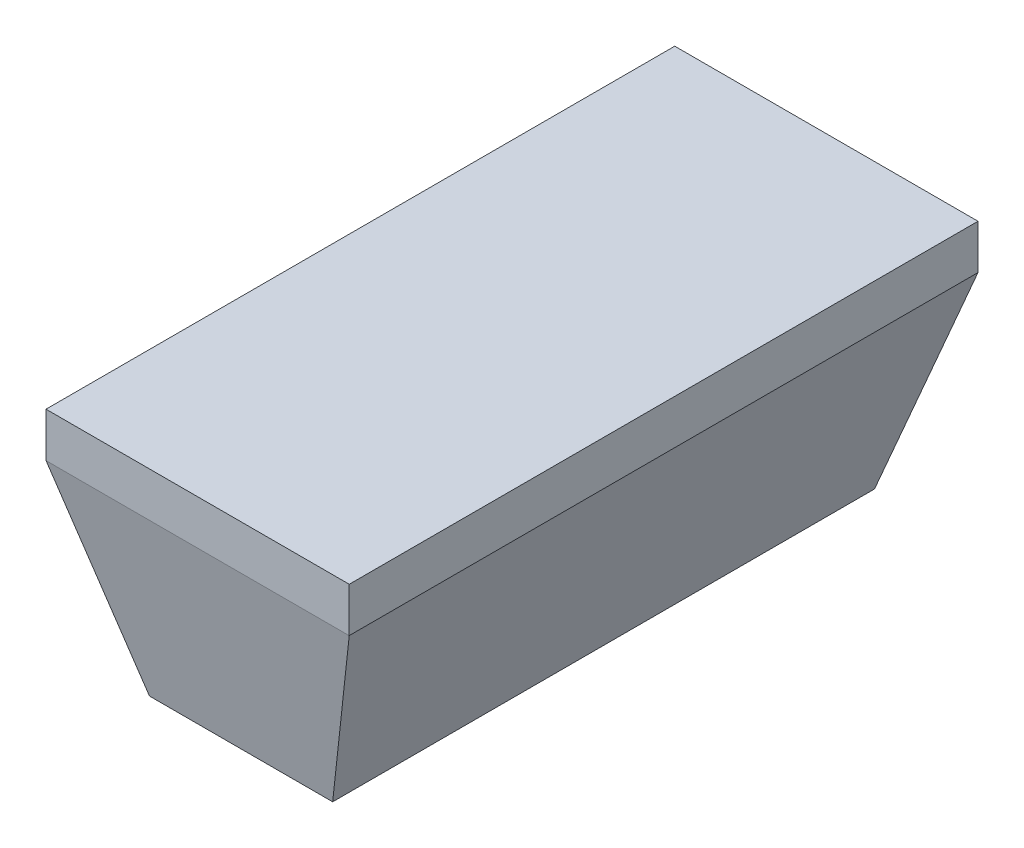
ISO-10303-21;
HEADER;
FILE_DESCRIPTION(('STEP AP214'),'2;1');
FILE_NAME('part.step','',(''),(''),'','','');
FILE_SCHEMA(('AUTOMOTIVE_DESIGN { 1 0 10303 214 1 1 1 1 }'));
ENDSEC;
DATA;
#1=APPLICATION_CONTEXT('core data for automotive mechanical design processes');
#2=APPLICATION_PROTOCOL_DEFINITION('international standard','automotive_design',2000,#1);
#3=PRODUCT_CONTEXT('',#1,'mechanical');
#4=PRODUCT('Part','Part','',(#3));
#5=PRODUCT_RELATED_PRODUCT_CATEGORY('part','',(#4));
#6=PRODUCT_DEFINITION_FORMATION('','',#4);
#7=PRODUCT_DEFINITION_CONTEXT('part definition',#1,'design');
#8=PRODUCT_DEFINITION('design','',#6,#7);
#9=PRODUCT_DEFINITION_SHAPE('','',#8);
#10=(LENGTH_UNIT() NAMED_UNIT(*) SI_UNIT(.MILLI.,.METRE.));
#11=(NAMED_UNIT(*) PLANE_ANGLE_UNIT() SI_UNIT($,.RADIAN.));
#12=(NAMED_UNIT(*) SI_UNIT($,.STERADIAN.) SOLID_ANGLE_UNIT());
#13=UNCERTAINTY_MEASURE_WITH_UNIT(LENGTH_MEASURE(1.E-05),#10,'distance_accuracy_value','');
#14=(GEOMETRIC_REPRESENTATION_CONTEXT(3) GLOBAL_UNCERTAINTY_ASSIGNED_CONTEXT((#13)) GLOBAL_UNIT_ASSIGNED_CONTEXT((#10,
#11,#12)) REPRESENTATION_CONTEXT('',''));
#15=CARTESIAN_POINT('',(0.,0.,0.));
#16=DIRECTION('',(0.,0.,1.));
#17=DIRECTION('',(1.,0.,0.));
#18=AXIS2_PLACEMENT_3D('',#15,#16,#17);
#19=CARTESIAN_POINT('',(-10.,1.18257126518984,8.355));
#20=DIRECTION('',(0.,-1.,0.));
#21=DIRECTION('',(0.,0.,-1.));
#22=AXIS2_PLACEMENT_3D('',#19,#20,#21);
#23=PLANE('',#22);
#24=DIRECTION('',(0.,0.,-1.));
#25=VECTOR('',#24,1.);
#26=CARTESIAN_POINT('',(-4.02966493200222,1.18257126518984,8.355));
#27=LINE('',#26,#25);
#28=CARTESIAN_POINT('',(-4.02966493200222,1.18257126518984,8.355));
#29=VERTEX_POINT('',#28);
#30=CARTESIAN_POINT('',(-4.02966493200222,1.18257126518984,-8.35499999999999));
#31=VERTEX_POINT('',#30);
#32=EDGE_CURVE('E211',#29,#31,#27,.T.);
#33=ORIENTED_EDGE('',*,*,#32,.F.);
#34=DIRECTION('',(1.,0.,0.));
#35=VECTOR('',#34,1.);
#36=CARTESIAN_POINT('',(-10.,1.18257126518984,8.355));
#37=LINE('',#36,#35);
#38=CARTESIAN_POINT('',(4.02966493200222,1.18257126518984,8.355));
#39=VERTEX_POINT('',#38);
#40=EDGE_CURVE('E228',#29,#39,#37,.T.);
#41=ORIENTED_EDGE('',*,*,#40,.T.);
#42=DIRECTION('',(0.,0.,1.));
#43=VECTOR('',#42,1.);
#44=CARTESIAN_POINT('',(4.02966493200222,1.18257126518984,8.355));
#45=LINE('',#44,#43);
#46=CARTESIAN_POINT('',(4.02966493200222,1.18257126518984,-8.35499999999999));
#47=VERTEX_POINT('',#46);
#48=EDGE_CURVE('E133',#47,#39,#45,.T.);
#49=ORIENTED_EDGE('',*,*,#48,.F.);
#50=DIRECTION('',(1.,0.,0.));
#51=VECTOR('',#50,1.);
#52=CARTESIAN_POINT('',(-10.,1.18257126518984,-8.35499999999999));
#53=LINE('',#52,#51);
#54=EDGE_CURVE('E47',#31,#47,#53,.T.);
#55=ORIENTED_EDGE('',*,*,#54,.F.);
#56=EDGE_LOOP('',(#33,#41,#49,#55));
#57=FACE_BOUND('',#56,.T.);
#58=ADVANCED_FACE('F111',(#57),#23,.F.);
#59=CARTESIAN_POINT('',(-10.,1.18257126518984,-8.35499999999999));
#60=DIRECTION('',(0.,0.,1.));
#61=DIRECTION('',(1.,0.,0.));
#62=AXIS2_PLACEMENT_3D('',#59,#60,#61);
#63=PLANE('',#62);
#64=DIRECTION('',(0.293177022535377,-0.956058174724368,0.));
#65=VECTOR('',#64,1.);
#66=CARTESIAN_POINT('',(-4.02966493200222,0.00133067430586715,-8.35499999999999));
#67=LINE('',#66,#65);
#68=CARTESIAN_POINT('',(-4.02966493200222,0.00133067430586715,-8.35499999999999));
#69=VERTEX_POINT('',#68);
#70=CARTESIAN_POINT('',(-4.02925687824433,0.,-8.35499999999999));
#71=VERTEX_POINT('',#70);
#72=EDGE_CURVE('E185',#69,#71,#67,.T.);
#73=ORIENTED_EDGE('',*,*,#72,.F.);
#74=DIRECTION('',(0.,-1.,0.));
#75=VECTOR('',#74,1.);
#76=CARTESIAN_POINT('',(-4.02966493200222,1.65881620398431,-8.35499999999999));
#77=LINE('',#76,#75);
#78=EDGE_CURVE('E206',#31,#69,#77,.T.);
#79=ORIENTED_EDGE('',*,*,#78,.F.);
#80=ORIENTED_EDGE('',*,*,#54,.T.);
#81=DIRECTION('',(0.,1.,0.));
#82=VECTOR('',#81,1.);
#83=CARTESIAN_POINT('',(4.02966493200222,0.00133067430586715,-8.35499999999999));
#84=LINE('',#83,#82);
#85=CARTESIAN_POINT('',(4.02966493200222,0.00133067430586715,-8.35499999999999));
#86=VERTEX_POINT('',#85);
#87=EDGE_CURVE('E204',#86,#47,#84,.T.);
#88=ORIENTED_EDGE('',*,*,#87,.F.);
#89=DIRECTION('',(0.293177022535377,0.956058174724368,0.));
#90=VECTOR('',#89,1.);
#91=CARTESIAN_POINT('',(4.02966493200222,0.00133067430586715,-8.35499999999999));
#92=LINE('',#91,#90);
#93=CARTESIAN_POINT('',(4.02925687824433,0.,-8.35499999999999));
#94=VERTEX_POINT('',#93);
#95=EDGE_CURVE('E182',#94,#86,#92,.T.);
#96=ORIENTED_EDGE('',*,*,#95,.F.);
#97=DIRECTION('',(1.,0.,0.));
#98=VECTOR('',#97,1.);
#99=CARTESIAN_POINT('',(-10.,0.,-8.35499999999999));
#100=LINE('',#99,#98);
#101=EDGE_CURVE('E118',#71,#94,#100,.T.);
#102=ORIENTED_EDGE('',*,*,#101,.F.);
#103=EDGE_LOOP('',(#73,#79,#80,#88,#96,#102));
#104=FACE_BOUND('',#103,.T.);
#105=ADVANCED_FACE('F245',(#104),#63,.F.);
#106=CARTESIAN_POINT('',(-10.,0.,-8.35499999999999));
#107=DIRECTION('',(0.,0.216875521623372,0.976199266605231));
#108=DIRECTION('',(0.,-0.976199266605231,0.216875521623373));
#109=AXIS2_PLACEMENT_3D('',#106,#107,#108);
#110=PLANE('',#109);
#111=DIRECTION('',(0.286779475732234,0.935195602117443,-0.207766017623043));
#112=VECTOR('',#111,1.);
#113=CARTESIAN_POINT('',(2.87545617256271,-3.76257520841882,-7.51909437203255));
#114=LINE('',#113,#112);
#115=CARTESIAN_POINT('',(2.4346671791149,-5.2,-7.19975152663928));
#116=VERTEX_POINT('',#115);
#117=EDGE_CURVE('E226',#116,#94,#114,.T.);
#118=ORIENTED_EDGE('',*,*,#117,.F.);
#119=DIRECTION('',(1.,0.,0.));
#120=VECTOR('',#119,1.);
#121=CARTESIAN_POINT('',(-10.,-5.2,-7.19975152663928));
#122=LINE('',#121,#120);
#123=CARTESIAN_POINT('',(-2.4346671791149,-5.2,-7.19975152663928));
#124=VERTEX_POINT('',#123);
#125=EDGE_CURVE('E234',#124,#116,#122,.T.);
#126=ORIENTED_EDGE('',*,*,#125,.F.);
#127=DIRECTION('',(0.286779475732234,-0.935195602117443,0.207766017623043));
#128=VECTOR('',#127,1.);
#129=CARTESIAN_POINT('',(-4.52030552658781,1.6013228812278,-8.71075496421076));
#130=LINE('',#129,#128);
#131=EDGE_CURVE('E219',#71,#124,#130,.T.);
#132=ORIENTED_EDGE('',*,*,#131,.F.);
#133=ORIENTED_EDGE('',*,*,#101,.T.);
#134=EDGE_LOOP('',(#118,#126,#132,#133));
#135=FACE_BOUND('',#134,.T.);
#136=ADVANCED_FACE('F241',(#135),#110,.F.);
#137=CARTESIAN_POINT('',(-10.,-5.2,7.20033634332094));
#138=DIRECTION('',(0.,-1.,0.));
#139=DIRECTION('',(0.,0.,-1.));
#140=AXIS2_PLACEMENT_3D('',#137,#138,#139);
#141=PLANE('',#140);
#142=ORIENTED_EDGE('',*,*,#125,.T.);
#143=DIRECTION('',(0.,0.,1.));
#144=VECTOR('',#143,1.);
#145=CARTESIAN_POINT('',(2.4346671791149,-5.2,7.20033634332094));
#146=LINE('',#145,#144);
#147=CARTESIAN_POINT('',(2.4346671791149,-5.2,7.20033634332094));
#148=VERTEX_POINT('',#147);
#149=EDGE_CURVE('E223',#116,#148,#146,.T.);
#150=ORIENTED_EDGE('',*,*,#149,.T.);
#151=DIRECTION('',(1.,0.,0.));
#152=VECTOR('',#151,1.);
#153=CARTESIAN_POINT('',(-10.,-5.2,7.20033634332094));
#154=LINE('',#153,#152);
#155=CARTESIAN_POINT('',(-2.4346671791149,-5.2,7.20033634332094));
#156=VERTEX_POINT('',#155);
#157=EDGE_CURVE('E231',#156,#148,#154,.T.);
#158=ORIENTED_EDGE('',*,*,#157,.F.);
#159=DIRECTION('',(0.,0.,-1.));
#160=VECTOR('',#159,1.);
#161=CARTESIAN_POINT('',(-2.4346671791149,-5.2,7.20033634332094));
#162=LINE('',#161,#160);
#163=EDGE_CURVE('E216',#156,#124,#162,.T.);
#164=ORIENTED_EDGE('',*,*,#163,.T.);
#165=EDGE_LOOP('',(#142,#150,#158,#164));
#166=FACE_BOUND('',#165,.T.);
#167=ADVANCED_FACE('F255',(#166),#141,.T.);
#168=CARTESIAN_POINT('',(-10.,0.,8.355));
#169=DIRECTION('',(0.,-0.216770893761959,0.976222505178836));
#170=DIRECTION('',(0.,-0.976222505178836,-0.216770893761959));
#171=AXIS2_PLACEMENT_3D('',#168,#169,#170);
#172=PLANE('',#171);
#173=ORIENTED_EDGE('',*,*,#157,.T.);
#174=DIRECTION('',(0.286785741088034,0.935216033611623,0.2076653779144));
#175=VECTOR('',#174,1.);
#176=CARTESIAN_POINT('',(2.87540575716328,-3.76273961439562,7.51948102263669));
#177=LINE('',#176,#175);
#178=CARTESIAN_POINT('',(4.02925687824433,0.,8.355));
#179=VERTEX_POINT('',#178);
#180=EDGE_CURVE('E221',#148,#179,#177,.T.);
#181=ORIENTED_EDGE('',*,*,#180,.T.);
#182=DIRECTION('',(1.,0.,0.));
#183=VECTOR('',#182,1.);
#184=CARTESIAN_POINT('',(-10.,0.,8.355));
#185=LINE('',#184,#183);
#186=CARTESIAN_POINT('',(-4.02925687824433,0.,8.355));
#187=VERTEX_POINT('',#186);
#188=EDGE_CURVE('E197',#187,#179,#185,.T.);
#189=ORIENTED_EDGE('',*,*,#188,.F.);
#190=DIRECTION('',(0.286785741088034,-0.935216033611623,-0.2076653779144));
#191=VECTOR('',#190,1.);
#192=CARTESIAN_POINT('',(-4.52032698299152,1.60139285113879,8.71059040870685));
#193=LINE('',#192,#191);
#194=EDGE_CURVE('E213',#187,#156,#193,.T.);
#195=ORIENTED_EDGE('',*,*,#194,.T.);
#196=EDGE_LOOP('',(#173,#181,#189,#195));
#197=FACE_BOUND('',#196,.T.);
#198=ADVANCED_FACE('F257',(#197),#172,.T.);
#199=CARTESIAN_POINT('',(-10.,0.,8.355));
#200=DIRECTION('',(0.,0.,-1.));
#201=DIRECTION('',(-1.,0.,0.));
#202=AXIS2_PLACEMENT_3D('',#199,#200,#201);
#203=PLANE('',#202);
#204=DIRECTION('',(0.293177022535377,-0.956058174724368,0.));
#205=VECTOR('',#204,1.);
#206=CARTESIAN_POINT('',(-4.02966493200222,0.00133067430586715,8.355));
#207=LINE('',#206,#205);
#208=CARTESIAN_POINT('',(-4.02966493200222,0.00133067430586715,8.355));
#209=VERTEX_POINT('',#208);
#210=EDGE_CURVE('E125',#209,#187,#207,.T.);
#211=ORIENTED_EDGE('',*,*,#210,.T.);
#212=ORIENTED_EDGE('',*,*,#188,.T.);
#213=DIRECTION('',(0.293177022535377,0.956058174724368,0.));
#214=VECTOR('',#213,1.);
#215=CARTESIAN_POINT('',(4.02966493200222,0.00133067430586715,8.355));
#216=LINE('',#215,#214);
#217=CARTESIAN_POINT('',(4.02966493200222,0.00133067430586715,8.355));
#218=VERTEX_POINT('',#217);
#219=EDGE_CURVE('E179',#179,#218,#216,.T.);
#220=ORIENTED_EDGE('',*,*,#219,.T.);
#221=DIRECTION('',(0.,1.,0.));
#222=VECTOR('',#221,1.);
#223=CARTESIAN_POINT('',(4.02966493200222,0.00133067430586715,8.355));
#224=LINE('',#223,#222);
#225=EDGE_CURVE('E187',#218,#39,#224,.T.);
#226=ORIENTED_EDGE('',*,*,#225,.T.);
#227=ORIENTED_EDGE('',*,*,#40,.F.);
#228=DIRECTION('',(0.,-1.,0.));
#229=VECTOR('',#228,1.);
#230=CARTESIAN_POINT('',(-4.02966493200222,1.65881620398431,8.355));
#231=LINE('',#230,#229);
#232=EDGE_CURVE('E192',#29,#209,#231,.T.);
#233=ORIENTED_EDGE('',*,*,#232,.T.);
#234=EDGE_LOOP('',(#211,#212,#220,#226,#227,#233));
#235=FACE_BOUND('',#234,.T.);
#236=ADVANCED_FACE('F195',(#235),#203,.F.);
#237=CARTESIAN_POINT('',(4.02966493200222,0.00133067430586715,-8.35499999999999));
#238=DIRECTION('',(1.,0.,0.));
#239=DIRECTION('',(0.,0.,-1.));
#240=AXIS2_PLACEMENT_3D('',#237,#238,#239);
#241=PLANE('',#240);
#242=ORIENTED_EDGE('',*,*,#48,.T.);
#243=ORIENTED_EDGE('',*,*,#225,.F.);
#244=DIRECTION('',(0.,0.,1.));
#245=VECTOR('',#244,1.);
#246=CARTESIAN_POINT('',(4.02966493200222,0.00133067430586715,-8.35499999999999));
#247=LINE('',#246,#245);
#248=EDGE_CURVE('E176',#86,#218,#247,.T.);
#249=ORIENTED_EDGE('',*,*,#248,.F.);
#250=ORIENTED_EDGE('',*,*,#87,.T.);
#251=EDGE_LOOP('',(#242,#243,#249,#250));
#252=FACE_BOUND('',#251,.T.);
#253=ADVANCED_FACE('F188',(#252),#241,.T.);
#254=CARTESIAN_POINT('',(4.02966493200222,0.00133067430586715,-8.35499999999999));
#255=DIRECTION('',(0.956058174724369,-0.293177022535377,0.));
#256=DIRECTION('',(0.293177022535377,0.956058174724369,0.));
#257=AXIS2_PLACEMENT_3D('',#254,#255,#256);
#258=PLANE('',#257);
#259=ORIENTED_EDGE('',*,*,#117,.T.);
#260=ORIENTED_EDGE('',*,*,#95,.T.);
#261=ORIENTED_EDGE('',*,*,#248,.T.);
#262=ORIENTED_EDGE('',*,*,#219,.F.);
#263=ORIENTED_EDGE('',*,*,#180,.F.);
#264=ORIENTED_EDGE('',*,*,#149,.F.);
#265=EDGE_LOOP('',(#259,#260,#261,#262,#263,#264));
#266=FACE_BOUND('',#265,.T.);
#267=ADVANCED_FACE('F177',(#266),#258,.T.);
#268=CARTESIAN_POINT('',(-4.02966493200222,0.00133067430586715,-8.35499999999999));
#269=DIRECTION('',(-0.956058174724369,-0.293177022535377,0.));
#270=DIRECTION('',(0.293177022535377,-0.956058174724369,0.));
#271=AXIS2_PLACEMENT_3D('',#268,#269,#270);
#272=PLANE('',#271);
#273=ORIENTED_EDGE('',*,*,#131,.T.);
#274=ORIENTED_EDGE('',*,*,#163,.F.);
#275=ORIENTED_EDGE('',*,*,#194,.F.);
#276=ORIENTED_EDGE('',*,*,#210,.F.);
#277=DIRECTION('',(0.,0.,1.));
#278=VECTOR('',#277,1.);
#279=CARTESIAN_POINT('',(-4.02966493200222,0.00133067430586715,-8.35499999999999));
#280=LINE('',#279,#278);
#281=EDGE_CURVE('E184',#69,#209,#280,.T.);
#282=ORIENTED_EDGE('',*,*,#281,.F.);
#283=ORIENTED_EDGE('',*,*,#72,.T.);
#284=EDGE_LOOP('',(#273,#274,#275,#276,#282,#283));
#285=FACE_BOUND('',#284,.T.);
#286=ADVANCED_FACE('F252',(#285),#272,.T.);
#287=CARTESIAN_POINT('',(-4.02966493200222,1.65881620398431,-8.35499999999999));
#288=DIRECTION('',(-1.,0.,0.));
#289=DIRECTION('',(0.,0.,1.));
#290=AXIS2_PLACEMENT_3D('',#287,#288,#289);
#291=PLANE('',#290);
#292=ORIENTED_EDGE('',*,*,#32,.T.);
#293=ORIENTED_EDGE('',*,*,#78,.T.);
#294=ORIENTED_EDGE('',*,*,#281,.T.);
#295=ORIENTED_EDGE('',*,*,#232,.F.);
#296=EDGE_LOOP('',(#292,#293,#294,#295));
#297=FACE_BOUND('',#296,.T.);
#298=ADVANCED_FACE('F251',(#297),#291,.T.);
#299=CLOSED_SHELL('',(#58,#105,#136,#167,#198,#236,#253,#267,#286,#298));
#300=MANIFOLD_SOLID_BREP('B7',#299);
#301=ADVANCED_BREP_SHAPE_REPRESENTATION('',(#18,#300),#14);
#302=SHAPE_DEFINITION_REPRESENTATION(#9,#301);
ENDSEC;
END-ISO-10303-21;
